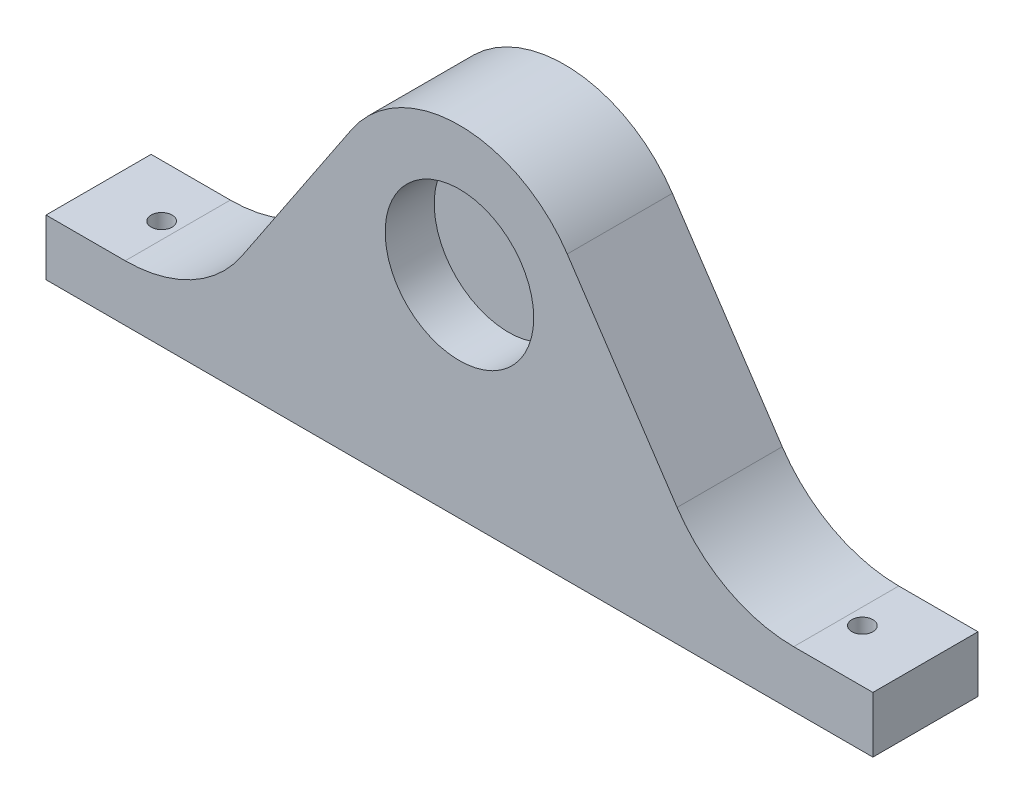
ISO-10303-21;
HEADER;
FILE_DESCRIPTION(('STEP AP214'),'2;1');
FILE_NAME('part.step','',(''),(''),'','','');
FILE_SCHEMA(('AUTOMOTIVE_DESIGN { 1 0 10303 214 1 1 1 1 }'));
ENDSEC;
DATA;
#1=APPLICATION_CONTEXT('core data for automotive mechanical design processes');
#2=APPLICATION_PROTOCOL_DEFINITION('international standard','automotive_design',2000,#1);
#3=PRODUCT_CONTEXT('',#1,'mechanical');
#4=PRODUCT('Part','Part','',(#3));
#5=PRODUCT_RELATED_PRODUCT_CATEGORY('part','',(#4));
#6=PRODUCT_DEFINITION_FORMATION('','',#4);
#7=PRODUCT_DEFINITION_CONTEXT('part definition',#1,'design');
#8=PRODUCT_DEFINITION('design','',#6,#7);
#9=PRODUCT_DEFINITION_SHAPE('','',#8);
#10=(LENGTH_UNIT() NAMED_UNIT(*) SI_UNIT(.MILLI.,.METRE.));
#11=(NAMED_UNIT(*) PLANE_ANGLE_UNIT() SI_UNIT($,.RADIAN.));
#12=(NAMED_UNIT(*) SI_UNIT($,.STERADIAN.) SOLID_ANGLE_UNIT());
#13=UNCERTAINTY_MEASURE_WITH_UNIT(LENGTH_MEASURE(1.E-05),#10,'distance_accuracy_value','');
#14=(GEOMETRIC_REPRESENTATION_CONTEXT(3) GLOBAL_UNCERTAINTY_ASSIGNED_CONTEXT((#13)) GLOBAL_UNIT_ASSIGNED_CONTEXT((#10,
#11,#12)) REPRESENTATION_CONTEXT('',''));
#15=CARTESIAN_POINT('',(0.,0.,0.));
#16=DIRECTION('',(0.,0.,1.));
#17=DIRECTION('',(1.,0.,0.));
#18=AXIS2_PLACEMENT_3D('',#15,#16,#17);
#19=CARTESIAN_POINT('',(47.6947504186015,-2.10000690711011,15.));
#20=DIRECTION('',(0.,0.,-1.));
#21=DIRECTION('',(-1.,0.,0.));
#22=AXIS2_PLACEMENT_3D('',#19,#20,#21);
#23=PLANE('',#22);
#24=DIRECTION('',(-1.,0.,0.));
#25=VECTOR('',#24,1.);
#26=CARTESIAN_POINT('',(59.,-22.1000069071101,15.));
#27=LINE('',#26,#25);
#28=CARTESIAN_POINT('',(59.,-22.1000069071101,15.));
#29=VERTEX_POINT('',#28);
#30=CARTESIAN_POINT('',(47.6947504186016,-22.1000069071101,15.));
#31=VERTEX_POINT('',#30);
#32=EDGE_CURVE('E162',#29,#31,#27,.T.);
#33=ORIENTED_EDGE('',*,*,#32,.T.);
#34=CARTESIAN_POINT('',(47.6947504186015,-2.10000690711011,15.));
#35=DIRECTION('',(0.,0.,-1.));
#36=DIRECTION('',(-1.,0.,0.));
#37=AXIS2_PLACEMENT_3D('',#34,#35,#36);
#38=CIRCLE('',#37,20.);
#39=CARTESIAN_POINT('',(31.0614376706177,-13.2055418797155,15.));
#40=VERTEX_POINT('',#39);
#41=EDGE_CURVE('E100',#31,#40,#38,.T.);
#42=ORIENTED_EDGE('',*,*,#41,.T.);
#43=DIRECTION('',(-0.555276748630274,0.831665637399184,0.));
#44=VECTOR('',#43,1.);
#45=CARTESIAN_POINT('',(31.0614376706177,-13.2055418797155,15.));
#46=LINE('',#45,#44);
#47=CARTESIAN_POINT('',(15.3858142918849,10.2726198496601,15.));
#48=VERTEX_POINT('',#47);
#49=EDGE_CURVE('E201',#40,#48,#46,.T.);
#50=ORIENTED_EDGE('',*,*,#49,.T.);
#51=CARTESIAN_POINT('',(0.,0.,15.));
#52=DIRECTION('',(0.,0.,1.));
#53=DIRECTION('',(1.,0.,0.));
#54=AXIS2_PLACEMENT_3D('',#51,#52,#53);
#55=CIRCLE('',#54,18.5);
#56=CARTESIAN_POINT('',(-15.3858142918849,10.2726198496601,15.));
#57=VERTEX_POINT('',#56);
#58=EDGE_CURVE('E198',#48,#57,#55,.T.);
#59=ORIENTED_EDGE('',*,*,#58,.T.);
#60=DIRECTION('',(-0.555276748630274,-0.831665637399184,0.));
#61=VECTOR('',#60,1.);
#62=CARTESIAN_POINT('',(-31.0614376706177,-13.2055418797155,15.));
#63=LINE('',#62,#61);
#64=CARTESIAN_POINT('',(-31.0614376706177,-13.2055418797155,15.));
#65=VERTEX_POINT('',#64);
#66=EDGE_CURVE('E200',#57,#65,#63,.T.);
#67=ORIENTED_EDGE('',*,*,#66,.T.);
#68=CARTESIAN_POINT('',(-47.6947504186015,-2.10000690711011,15.));
#69=DIRECTION('',(0.,0.,-1.));
#70=DIRECTION('',(1.,0.,0.));
#71=AXIS2_PLACEMENT_3D('',#68,#69,#70);
#72=CIRCLE('',#71,20.);
#73=CARTESIAN_POINT('',(-47.6947504186016,-22.1000069071101,15.));
#74=VERTEX_POINT('',#73);
#75=EDGE_CURVE('E203',#65,#74,#72,.T.);
#76=ORIENTED_EDGE('',*,*,#75,.T.);
#77=DIRECTION('',(-1.,0.,0.));
#78=VECTOR('',#77,1.);
#79=CARTESIAN_POINT('',(-59.,-22.1000069071101,15.));
#80=LINE('',#79,#78);
#81=CARTESIAN_POINT('',(-59.,-22.1000069071101,15.));
#82=VERTEX_POINT('',#81);
#83=EDGE_CURVE('E125',#74,#82,#80,.T.);
#84=ORIENTED_EDGE('',*,*,#83,.T.);
#85=DIRECTION('',(0.,-1.,0.));
#86=VECTOR('',#85,1.);
#87=CARTESIAN_POINT('',(-59.,-30.1,15.));
#88=LINE('',#87,#86);
#89=CARTESIAN_POINT('',(-59.,-30.1,15.));
#90=VERTEX_POINT('',#89);
#91=EDGE_CURVE('E119',#82,#90,#88,.T.);
#92=ORIENTED_EDGE('',*,*,#91,.T.);
#93=DIRECTION('',(1.,0.,0.));
#94=VECTOR('',#93,1.);
#95=CARTESIAN_POINT('',(-59.,-30.1,15.));
#96=LINE('',#95,#94);
#97=CARTESIAN_POINT('',(59.,-30.1,15.));
#98=VERTEX_POINT('',#97);
#99=EDGE_CURVE('E123',#90,#98,#96,.T.);
#100=ORIENTED_EDGE('',*,*,#99,.T.);
#101=DIRECTION('',(0.,1.,0.));
#102=VECTOR('',#101,1.);
#103=CARTESIAN_POINT('',(59.,-30.1,15.));
#104=LINE('',#103,#102);
#105=EDGE_CURVE('E50',#98,#29,#104,.T.);
#106=ORIENTED_EDGE('',*,*,#105,.T.);
#107=EDGE_LOOP('',(#33,#42,#50,#59,#67,#76,#84,#92,#100,#106));
#108=FACE_BOUND('',#107,.T.);
#109=CARTESIAN_POINT('',(0.,0.,15.));
#110=DIRECTION('',(0.,0.,1.));
#111=DIRECTION('',(1.,0.,0.));
#112=AXIS2_PLACEMENT_3D('',#109,#110,#111);
#113=CIRCLE('',#112,10.6);
#114=CARTESIAN_POINT('',(10.6,0.,15.));
#115=VERTEX_POINT('',#114);
#116=EDGE_CURVE('E147',#115,#115,#113,.T.);
#117=ORIENTED_EDGE('',*,*,#116,.F.);
#118=EDGE_LOOP('',(#117));
#119=FACE_BOUND('',#118,.T.);
#120=ADVANCED_FACE('F33',(#108,#119),#23,.F.);
#121=CARTESIAN_POINT('',(47.6947504186015,-2.10000690711011,0.));
#122=DIRECTION('',(0.,0.,-1.));
#123=DIRECTION('',(-1.,0.,0.));
#124=AXIS2_PLACEMENT_3D('',#121,#122,#123);
#125=PLANE('',#124);
#126=DIRECTION('',(-1.,0.,0.));
#127=VECTOR('',#126,1.);
#128=CARTESIAN_POINT('',(59.,-22.1000069071101,0.));
#129=LINE('',#128,#127);
#130=CARTESIAN_POINT('',(59.,-22.1000069071101,0.));
#131=VERTEX_POINT('',#130);
#132=CARTESIAN_POINT('',(47.6947504186016,-22.1000069071101,0.));
#133=VERTEX_POINT('',#132);
#134=EDGE_CURVE('E143',#131,#133,#129,.T.);
#135=ORIENTED_EDGE('',*,*,#134,.F.);
#136=DIRECTION('',(0.,1.,0.));
#137=VECTOR('',#136,1.);
#138=CARTESIAN_POINT('',(59.,-30.1,0.));
#139=LINE('',#138,#137);
#140=CARTESIAN_POINT('',(59.,-30.1,0.));
#141=VERTEX_POINT('',#140);
#142=EDGE_CURVE('E91',#141,#131,#139,.T.);
#143=ORIENTED_EDGE('',*,*,#142,.F.);
#144=DIRECTION('',(1.,0.,0.));
#145=VECTOR('',#144,1.);
#146=CARTESIAN_POINT('',(-59.,-30.1,0.));
#147=LINE('',#146,#145);
#148=CARTESIAN_POINT('',(-59.,-30.1,0.));
#149=VERTEX_POINT('',#148);
#150=EDGE_CURVE('E85',#149,#141,#147,.T.);
#151=ORIENTED_EDGE('',*,*,#150,.F.);
#152=DIRECTION('',(0.,-1.,0.));
#153=VECTOR('',#152,1.);
#154=CARTESIAN_POINT('',(-59.,-30.1,0.));
#155=LINE('',#154,#153);
#156=CARTESIAN_POINT('',(-59.,-22.1000069071101,0.));
#157=VERTEX_POINT('',#156);
#158=EDGE_CURVE('E133',#157,#149,#155,.T.);
#159=ORIENTED_EDGE('',*,*,#158,.F.);
#160=DIRECTION('',(-1.,0.,0.));
#161=VECTOR('',#160,1.);
#162=CARTESIAN_POINT('',(-59.,-22.1000069071101,0.));
#163=LINE('',#162,#161);
#164=CARTESIAN_POINT('',(-47.6947504186016,-22.1000069071101,0.));
#165=VERTEX_POINT('',#164);
#166=EDGE_CURVE('E157',#165,#157,#163,.T.);
#167=ORIENTED_EDGE('',*,*,#166,.F.);
#168=CARTESIAN_POINT('',(-47.6947504186015,-2.10000690711011,0.));
#169=DIRECTION('',(0.,0.,-1.));
#170=DIRECTION('',(1.,0.,0.));
#171=AXIS2_PLACEMENT_3D('',#168,#169,#170);
#172=CIRCLE('',#171,20.);
#173=CARTESIAN_POINT('',(-31.0614376706177,-13.2055418797155,0.));
#174=VERTEX_POINT('',#173);
#175=EDGE_CURVE('E155',#174,#165,#172,.T.);
#176=ORIENTED_EDGE('',*,*,#175,.F.);
#177=DIRECTION('',(-0.555276748630274,-0.831665637399184,0.));
#178=VECTOR('',#177,1.);
#179=CARTESIAN_POINT('',(-31.0614376706177,-13.2055418797155,0.));
#180=LINE('',#179,#178);
#181=CARTESIAN_POINT('',(-15.3858142918849,10.2726198496601,0.));
#182=VERTEX_POINT('',#181);
#183=EDGE_CURVE('E153',#182,#174,#180,.T.);
#184=ORIENTED_EDGE('',*,*,#183,.F.);
#185=CARTESIAN_POINT('',(0.,0.,0.));
#186=DIRECTION('',(0.,0.,1.));
#187=DIRECTION('',(1.,0.,0.));
#188=AXIS2_PLACEMENT_3D('',#185,#186,#187);
#189=CIRCLE('',#188,18.5);
#190=CARTESIAN_POINT('',(15.3858142918849,10.2726198496601,0.));
#191=VERTEX_POINT('',#190);
#192=EDGE_CURVE('E151',#191,#182,#189,.T.);
#193=ORIENTED_EDGE('',*,*,#192,.F.);
#194=DIRECTION('',(-0.555276748630274,0.831665637399184,0.));
#195=VECTOR('',#194,1.);
#196=CARTESIAN_POINT('',(31.0614376706177,-13.2055418797155,0.));
#197=LINE('',#196,#195);
#198=CARTESIAN_POINT('',(31.0614376706177,-13.2055418797155,0.));
#199=VERTEX_POINT('',#198);
#200=EDGE_CURVE('E149',#199,#191,#197,.T.);
#201=ORIENTED_EDGE('',*,*,#200,.F.);
#202=CARTESIAN_POINT('',(47.6947504186015,-2.10000690711011,0.));
#203=DIRECTION('',(0.,0.,-1.));
#204=DIRECTION('',(-1.,0.,0.));
#205=AXIS2_PLACEMENT_3D('',#202,#203,#204);
#206=CIRCLE('',#205,20.);
#207=EDGE_CURVE('E146',#133,#199,#206,.T.);
#208=ORIENTED_EDGE('',*,*,#207,.F.);
#209=EDGE_LOOP('',(#135,#143,#151,#159,#167,#176,#184,#193,#201,#208));
#210=FACE_BOUND('',#209,.T.);
#211=ADVANCED_FACE('F186',(#210),#125,.T.);
#212=CARTESIAN_POINT('',(59.,-22.1000069071101,15.));
#213=DIRECTION('',(0.,-1.,0.));
#214=DIRECTION('',(1.,0.,0.));
#215=AXIS2_PLACEMENT_3D('',#212,#213,#214);
#216=PLANE('',#215);
#217=CARTESIAN_POINT('',(50.,-22.1000069071101,7.5));
#218=DIRECTION('',(0.,-1.,0.));
#219=DIRECTION('',(1.,0.,0.));
#220=AXIS2_PLACEMENT_3D('',#217,#218,#219);
#221=CIRCLE('',#220,1.5);
#222=CARTESIAN_POINT('',(51.5,-22.1000069071101,7.5));
#223=VERTEX_POINT('',#222);
#224=EDGE_CURVE('E257',#223,#223,#221,.T.);
#225=ORIENTED_EDGE('',*,*,#224,.T.);
#226=EDGE_LOOP('',(#225));
#227=FACE_BOUND('',#226,.T.);
#228=ORIENTED_EDGE('',*,*,#134,.T.);
#229=DIRECTION('',(0.,0.,-1.));
#230=VECTOR('',#229,1.);
#231=CARTESIAN_POINT('',(47.6947504186016,-22.1000069071101,15.));
#232=LINE('',#231,#230);
#233=EDGE_CURVE('E42',#31,#133,#232,.T.);
#234=ORIENTED_EDGE('',*,*,#233,.F.);
#235=ORIENTED_EDGE('',*,*,#32,.F.);
#236=DIRECTION('',(0.,0.,-1.));
#237=VECTOR('',#236,1.);
#238=CARTESIAN_POINT('',(59.,-22.1000069071101,15.));
#239=LINE('',#238,#237);
#240=EDGE_CURVE('E139',#29,#131,#239,.T.);
#241=ORIENTED_EDGE('',*,*,#240,.T.);
#242=EDGE_LOOP('',(#228,#234,#235,#241));
#243=FACE_BOUND('',#242,.T.);
#244=ADVANCED_FACE('F35',(#227,#243),#216,.F.);
#245=CARTESIAN_POINT('',(47.6947504186015,-2.10000690711011,15.));
#246=DIRECTION('',(0.,0.,-1.));
#247=DIRECTION('',(-1.,0.,0.));
#248=AXIS2_PLACEMENT_3D('',#245,#246,#247);
#249=CYLINDRICAL_SURFACE('',#248,20.);
#250=ORIENTED_EDGE('',*,*,#207,.T.);
#251=DIRECTION('',(0.,0.,-1.));
#252=VECTOR('',#251,1.);
#253=CARTESIAN_POINT('',(31.0614376706177,-13.2055418797155,15.));
#254=LINE('',#253,#252);
#255=EDGE_CURVE('E178',#40,#199,#254,.T.);
#256=ORIENTED_EDGE('',*,*,#255,.F.);
#257=ORIENTED_EDGE('',*,*,#41,.F.);
#258=ORIENTED_EDGE('',*,*,#233,.T.);
#259=EDGE_LOOP('',(#250,#256,#257,#258));
#260=FACE_BOUND('',#259,.T.);
#261=ADVANCED_FACE('F181',(#260),#249,.F.);
#262=CARTESIAN_POINT('',(31.0614376706177,-13.2055418797155,15.));
#263=DIRECTION('',(-0.831665637399184,-0.555276748630274,0.));
#264=DIRECTION('',(0.555276748630274,-0.831665637399184,0.));
#265=AXIS2_PLACEMENT_3D('',#262,#263,#264);
#266=PLANE('',#265);
#267=ORIENTED_EDGE('',*,*,#200,.T.);
#268=DIRECTION('',(0.,0.,-1.));
#269=VECTOR('',#268,1.);
#270=CARTESIAN_POINT('',(15.3858142918849,10.2726198496601,15.));
#271=LINE('',#270,#269);
#272=EDGE_CURVE('E175',#48,#191,#271,.T.);
#273=ORIENTED_EDGE('',*,*,#272,.F.);
#274=ORIENTED_EDGE('',*,*,#49,.F.);
#275=ORIENTED_EDGE('',*,*,#255,.T.);
#276=EDGE_LOOP('',(#267,#273,#274,#275));
#277=FACE_BOUND('',#276,.T.);
#278=ADVANCED_FACE('F192',(#277),#266,.F.);
#279=CARTESIAN_POINT('',(0.,0.,15.));
#280=DIRECTION('',(0.,0.,-1.));
#281=DIRECTION('',(-1.,0.,0.));
#282=AXIS2_PLACEMENT_3D('',#279,#280,#281);
#283=CYLINDRICAL_SURFACE('',#282,18.5);
#284=ORIENTED_EDGE('',*,*,#192,.T.);
#285=DIRECTION('',(0.,0.,-1.));
#286=VECTOR('',#285,1.);
#287=CARTESIAN_POINT('',(-15.3858142918849,10.2726198496601,15.));
#288=LINE('',#287,#286);
#289=EDGE_CURVE('E172',#57,#182,#288,.T.);
#290=ORIENTED_EDGE('',*,*,#289,.F.);
#291=ORIENTED_EDGE('',*,*,#58,.F.);
#292=ORIENTED_EDGE('',*,*,#272,.T.);
#293=EDGE_LOOP('',(#284,#290,#291,#292));
#294=FACE_BOUND('',#293,.T.);
#295=ADVANCED_FACE('F196',(#294),#283,.T.);
#296=CARTESIAN_POINT('',(-31.0614376706177,-13.2055418797155,15.));
#297=DIRECTION('',(0.831665637399184,-0.555276748630274,0.));
#298=DIRECTION('',(0.555276748630274,0.831665637399184,0.));
#299=AXIS2_PLACEMENT_3D('',#296,#297,#298);
#300=PLANE('',#299);
#301=ORIENTED_EDGE('',*,*,#183,.T.);
#302=DIRECTION('',(0.,0.,-1.));
#303=VECTOR('',#302,1.);
#304=CARTESIAN_POINT('',(-31.0614376706177,-13.2055418797155,15.));
#305=LINE('',#304,#303);
#306=EDGE_CURVE('E169',#65,#174,#305,.T.);
#307=ORIENTED_EDGE('',*,*,#306,.F.);
#308=ORIENTED_EDGE('',*,*,#66,.F.);
#309=ORIENTED_EDGE('',*,*,#289,.T.);
#310=EDGE_LOOP('',(#301,#307,#308,#309));
#311=FACE_BOUND('',#310,.T.);
#312=ADVANCED_FACE('F218',(#311),#300,.F.);
#313=CARTESIAN_POINT('',(-47.6947504186015,-2.10000690711011,15.));
#314=DIRECTION('',(0.,0.,-1.));
#315=DIRECTION('',(-1.,0.,0.));
#316=AXIS2_PLACEMENT_3D('',#313,#314,#315);
#317=CYLINDRICAL_SURFACE('',#316,20.);
#318=ORIENTED_EDGE('',*,*,#175,.T.);
#319=DIRECTION('',(0.,0.,-1.));
#320=VECTOR('',#319,1.);
#321=CARTESIAN_POINT('',(-47.6947504186016,-22.1000069071101,15.));
#322=LINE('',#321,#320);
#323=EDGE_CURVE('E166',#74,#165,#322,.T.);
#324=ORIENTED_EDGE('',*,*,#323,.F.);
#325=ORIENTED_EDGE('',*,*,#75,.F.);
#326=ORIENTED_EDGE('',*,*,#306,.T.);
#327=EDGE_LOOP('',(#318,#324,#325,#326));
#328=FACE_BOUND('',#327,.T.);
#329=ADVANCED_FACE('F212',(#328),#317,.F.);
#330=CARTESIAN_POINT('',(-59.,-22.1000069071101,15.));
#331=DIRECTION('',(0.,-1.,0.));
#332=DIRECTION('',(1.,0.,0.));
#333=AXIS2_PLACEMENT_3D('',#330,#331,#332);
#334=PLANE('',#333);
#335=CARTESIAN_POINT('',(-50.,-22.1000069071101,7.5));
#336=DIRECTION('',(0.,-1.,0.));
#337=DIRECTION('',(1.,0.,0.));
#338=AXIS2_PLACEMENT_3D('',#335,#336,#337);
#339=CIRCLE('',#338,1.5);
#340=CARTESIAN_POINT('',(-48.5,-22.1000069071101,7.5));
#341=VERTEX_POINT('',#340);
#342=EDGE_CURVE('E251',#341,#341,#339,.T.);
#343=ORIENTED_EDGE('',*,*,#342,.T.);
#344=EDGE_LOOP('',(#343));
#345=FACE_BOUND('',#344,.T.);
#346=ORIENTED_EDGE('',*,*,#166,.T.);
#347=DIRECTION('',(0.,0.,-1.));
#348=VECTOR('',#347,1.);
#349=CARTESIAN_POINT('',(-59.,-22.1000069071101,15.));
#350=LINE('',#349,#348);
#351=EDGE_CURVE('E134',#82,#157,#350,.T.);
#352=ORIENTED_EDGE('',*,*,#351,.F.);
#353=ORIENTED_EDGE('',*,*,#83,.F.);
#354=ORIENTED_EDGE('',*,*,#323,.T.);
#355=EDGE_LOOP('',(#346,#352,#353,#354));
#356=FACE_BOUND('',#355,.T.);
#357=ADVANCED_FACE('F216',(#345,#356),#334,.F.);
#358=CARTESIAN_POINT('',(-59.,-30.1,15.));
#359=DIRECTION('',(1.,0.,0.));
#360=DIRECTION('',(0.,0.,-1.));
#361=AXIS2_PLACEMENT_3D('',#358,#359,#360);
#362=PLANE('',#361);
#363=ORIENTED_EDGE('',*,*,#158,.T.);
#364=DIRECTION('',(0.,0.,-1.));
#365=VECTOR('',#364,1.);
#366=CARTESIAN_POINT('',(-59.,-30.1,15.));
#367=LINE('',#366,#365);
#368=EDGE_CURVE('E130',#90,#149,#367,.T.);
#369=ORIENTED_EDGE('',*,*,#368,.F.);
#370=ORIENTED_EDGE('',*,*,#91,.F.);
#371=ORIENTED_EDGE('',*,*,#351,.T.);
#372=EDGE_LOOP('',(#363,#369,#370,#371));
#373=FACE_BOUND('',#372,.T.);
#374=ADVANCED_FACE('F131',(#373),#362,.F.);
#375=CARTESIAN_POINT('',(-59.,-30.1,15.));
#376=DIRECTION('',(0.,1.,0.));
#377=DIRECTION('',(0.,0.,1.));
#378=AXIS2_PLACEMENT_3D('',#375,#376,#377);
#379=PLANE('',#378);
#380=CARTESIAN_POINT('',(-50.,-30.1,7.5));
#381=DIRECTION('',(0.,-1.,0.));
#382=DIRECTION('',(0.,0.,1.));
#383=AXIS2_PLACEMENT_3D('',#380,#381,#382);
#384=CIRCLE('',#383,1.5);
#385=CARTESIAN_POINT('',(-50.,-30.1,9.));
#386=VERTEX_POINT('',#385);
#387=EDGE_CURVE('E254',#386,#386,#384,.T.);
#388=ORIENTED_EDGE('',*,*,#387,.F.);
#389=EDGE_LOOP('',(#388));
#390=FACE_BOUND('',#389,.T.);
#391=CARTESIAN_POINT('',(50.,-30.1,7.5));
#392=DIRECTION('',(0.,-1.,0.));
#393=DIRECTION('',(0.,0.,-1.));
#394=AXIS2_PLACEMENT_3D('',#391,#392,#393);
#395=CIRCLE('',#394,1.5);
#396=CARTESIAN_POINT('',(50.,-30.1,6.));
#397=VERTEX_POINT('',#396);
#398=EDGE_CURVE('E253',#397,#397,#395,.T.);
#399=ORIENTED_EDGE('',*,*,#398,.F.);
#400=EDGE_LOOP('',(#399));
#401=FACE_BOUND('',#400,.T.);
#402=ORIENTED_EDGE('',*,*,#150,.T.);
#403=DIRECTION('',(0.,0.,-1.));
#404=VECTOR('',#403,1.);
#405=CARTESIAN_POINT('',(59.,-30.1,15.));
#406=LINE('',#405,#404);
#407=EDGE_CURVE('E135',#98,#141,#406,.T.);
#408=ORIENTED_EDGE('',*,*,#407,.F.);
#409=ORIENTED_EDGE('',*,*,#99,.F.);
#410=ORIENTED_EDGE('',*,*,#368,.T.);
#411=EDGE_LOOP('',(#402,#408,#409,#410));
#412=FACE_BOUND('',#411,.T.);
#413=ADVANCED_FACE('F137',(#390,#401,#412),#379,.F.);
#414=CARTESIAN_POINT('',(59.,-30.1,15.));
#415=DIRECTION('',(-1.,0.,0.));
#416=DIRECTION('',(0.,0.,1.));
#417=AXIS2_PLACEMENT_3D('',#414,#415,#416);
#418=PLANE('',#417);
#419=ORIENTED_EDGE('',*,*,#142,.T.);
#420=ORIENTED_EDGE('',*,*,#240,.F.);
#421=ORIENTED_EDGE('',*,*,#105,.F.);
#422=ORIENTED_EDGE('',*,*,#407,.T.);
#423=EDGE_LOOP('',(#419,#420,#421,#422));
#424=FACE_BOUND('',#423,.T.);
#425=ADVANCED_FACE('F237',(#424),#418,.F.);
#426=CARTESIAN_POINT('',(0.,0.,15.));
#427=DIRECTION('',(0.,0.,-1.));
#428=DIRECTION('',(-1.,0.,0.));
#429=AXIS2_PLACEMENT_3D('',#426,#427,#428);
#430=CYLINDRICAL_SURFACE('',#429,10.6);
#431=CARTESIAN_POINT('',(0.,0.,8.));
#432=DIRECTION('',(0.,0.,1.));
#433=DIRECTION('',(1.,0.,0.));
#434=AXIS2_PLACEMENT_3D('',#431,#432,#433);
#435=CIRCLE('',#434,10.6);
#436=CARTESIAN_POINT('',(10.6,0.,8.));
#437=VERTEX_POINT('',#436);
#438=EDGE_CURVE('E11',#437,#437,#435,.T.);
#439=ORIENTED_EDGE('',*,*,#438,.F.);
#440=EDGE_LOOP('',(#439));
#441=FACE_BOUND('',#440,.T.);
#442=ORIENTED_EDGE('',*,*,#116,.T.);
#443=EDGE_LOOP('',(#442));
#444=FACE_BOUND('',#443,.T.);
#445=ADVANCED_FACE('F234',(#441,#444),#430,.F.);
#446=CARTESIAN_POINT('',(50.,-15.1,7.5));
#447=DIRECTION('',(0.,-1.,0.));
#448=DIRECTION('',(0.,0.,-1.));
#449=AXIS2_PLACEMENT_3D('',#446,#447,#448);
#450=CYLINDRICAL_SURFACE('',#449,1.5);
#451=ORIENTED_EDGE('',*,*,#398,.T.);
#452=EDGE_LOOP('',(#451));
#453=FACE_BOUND('',#452,.T.);
#454=ORIENTED_EDGE('',*,*,#224,.F.);
#455=EDGE_LOOP('',(#454));
#456=FACE_BOUND('',#455,.T.);
#457=ADVANCED_FACE('F269',(#453,#456),#450,.F.);
#458=CARTESIAN_POINT('',(-50.,-15.1,7.5));
#459=DIRECTION('',(0.,-1.,0.));
#460=DIRECTION('',(0.,0.,-1.));
#461=AXIS2_PLACEMENT_3D('',#458,#459,#460);
#462=CYLINDRICAL_SURFACE('',#461,1.5);
#463=ORIENTED_EDGE('',*,*,#387,.T.);
#464=EDGE_LOOP('',(#463));
#465=FACE_BOUND('',#464,.T.);
#466=ORIENTED_EDGE('',*,*,#342,.F.);
#467=EDGE_LOOP('',(#466));
#468=FACE_BOUND('',#467,.T.);
#469=ADVANCED_FACE('F274',(#465,#468),#462,.F.);
#470=CARTESIAN_POINT('',(0.,0.,8.));
#471=DIRECTION('',(0.,0.,1.));
#472=DIRECTION('',(1.,0.,0.));
#473=AXIS2_PLACEMENT_3D('',#470,#471,#472);
#474=PLANE('',#473);
#475=ORIENTED_EDGE('',*,*,#438,.T.);
#476=EDGE_LOOP('',(#475));
#477=FACE_BOUND('',#476,.T.);
#478=ADVANCED_FACE('F278',(#477),#474,.T.);
#479=CLOSED_SHELL('',(#120,#211,#244,#261,#278,#295,#312,#329,#357,#374,#413,#425,#445,#457,
#469,#478));
#480=MANIFOLD_SOLID_BREP('B2',#479);
#481=ADVANCED_BREP_SHAPE_REPRESENTATION('',(#18,#480),#14);
#482=SHAPE_DEFINITION_REPRESENTATION(#9,#481);
ENDSEC;
END-ISO-10303-21;
